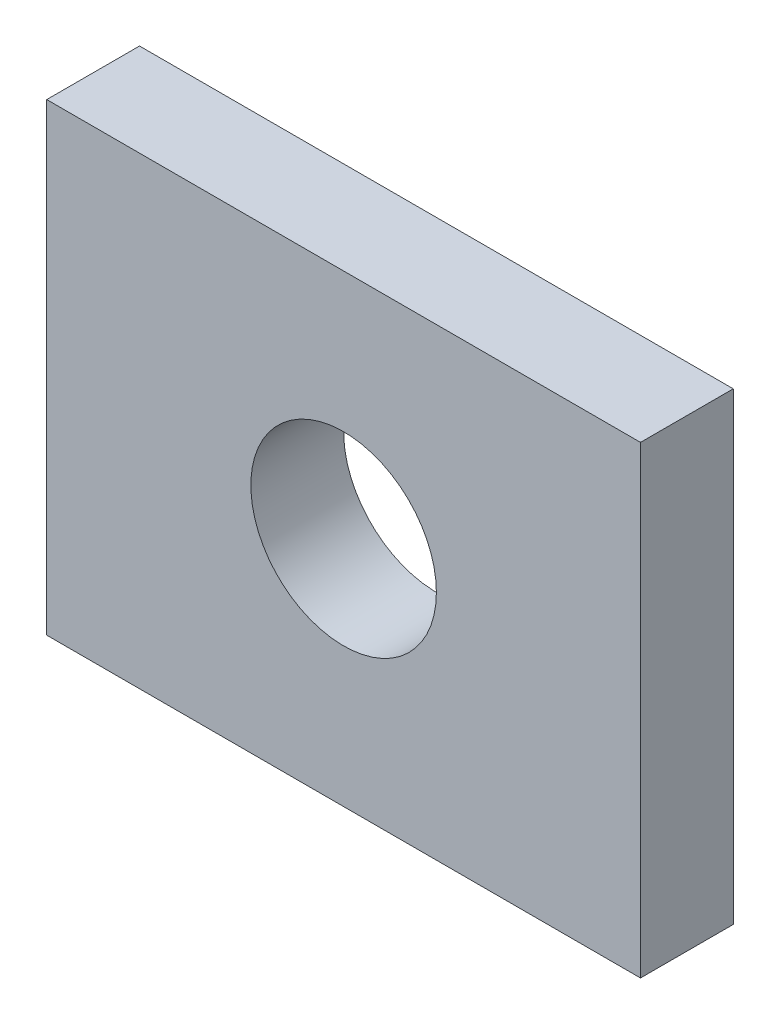
ISO-10303-21;
HEADER;
FILE_DESCRIPTION(('STEP AP214'),'2;1');
FILE_NAME('part.step','',(''),(''),'','','');
FILE_SCHEMA(('AUTOMOTIVE_DESIGN { 1 0 10303 214 1 1 1 1 }'));
ENDSEC;
DATA;
#1=APPLICATION_CONTEXT('core data for automotive mechanical design processes');
#2=APPLICATION_PROTOCOL_DEFINITION('international standard','automotive_design',2000,#1);
#3=PRODUCT_CONTEXT('',#1,'mechanical');
#4=PRODUCT('Part','Part','',(#3));
#5=PRODUCT_RELATED_PRODUCT_CATEGORY('part','',(#4));
#6=PRODUCT_DEFINITION_FORMATION('','',#4);
#7=PRODUCT_DEFINITION_CONTEXT('part definition',#1,'design');
#8=PRODUCT_DEFINITION('design','',#6,#7);
#9=PRODUCT_DEFINITION_SHAPE('','',#8);
#10=(LENGTH_UNIT() NAMED_UNIT(*) SI_UNIT(.MILLI.,.METRE.));
#11=(NAMED_UNIT(*) PLANE_ANGLE_UNIT() SI_UNIT($,.RADIAN.));
#12=(NAMED_UNIT(*) SI_UNIT($,.STERADIAN.) SOLID_ANGLE_UNIT());
#13=UNCERTAINTY_MEASURE_WITH_UNIT(LENGTH_MEASURE(1.E-05),#10,'distance_accuracy_value','');
#14=(GEOMETRIC_REPRESENTATION_CONTEXT(3) GLOBAL_UNCERTAINTY_ASSIGNED_CONTEXT((#13)) GLOBAL_UNIT_ASSIGNED_CONTEXT((#10,
#11,#12)) REPRESENTATION_CONTEXT('',''));
#15=CARTESIAN_POINT('',(0.,0.,0.));
#16=DIRECTION('',(0.,0.,1.));
#17=DIRECTION('',(1.,0.,0.));
#18=AXIS2_PLACEMENT_3D('',#15,#16,#17);
#19=CARTESIAN_POINT('',(0.,0.,5.));
#20=DIRECTION('',(0.,0.,-1.));
#21=DIRECTION('',(-1.,0.,0.));
#22=AXIS2_PLACEMENT_3D('',#19,#20,#21);
#23=PLANE('',#22);
#24=DIRECTION('',(0.,1.,0.));
#25=VECTOR('',#24,1.);
#26=CARTESIAN_POINT('',(16.,-12.5,5.));
#27=LINE('',#26,#25);
#28=CARTESIAN_POINT('',(16.,-12.5,5.));
#29=VERTEX_POINT('',#28);
#30=CARTESIAN_POINT('',(16.,12.5,5.));
#31=VERTEX_POINT('',#30);
#32=EDGE_CURVE('E96',#29,#31,#27,.T.);
#33=ORIENTED_EDGE('',*,*,#32,.T.);
#34=DIRECTION('',(-1.,0.,0.));
#35=VECTOR('',#34,1.);
#36=CARTESIAN_POINT('',(-16.,12.5,5.));
#37=LINE('',#36,#35);
#38=CARTESIAN_POINT('',(-16.,12.5,5.));
#39=VERTEX_POINT('',#38);
#40=EDGE_CURVE('E91',#31,#39,#37,.T.);
#41=ORIENTED_EDGE('',*,*,#40,.T.);
#42=DIRECTION('',(0.,-1.,0.));
#43=VECTOR('',#42,1.);
#44=CARTESIAN_POINT('',(-16.,-12.5,5.));
#45=LINE('',#44,#43);
#46=CARTESIAN_POINT('',(-16.,-12.5,5.));
#47=VERTEX_POINT('',#46);
#48=EDGE_CURVE('E94',#39,#47,#45,.T.);
#49=ORIENTED_EDGE('',*,*,#48,.T.);
#50=DIRECTION('',(1.,0.,0.));
#51=VECTOR('',#50,1.);
#52=CARTESIAN_POINT('',(-16.,-12.5,5.));
#53=LINE('',#52,#51);
#54=EDGE_CURVE('E61',#47,#29,#53,.T.);
#55=ORIENTED_EDGE('',*,*,#54,.T.);
#56=EDGE_LOOP('',(#33,#41,#49,#55));
#57=FACE_BOUND('',#56,.T.);
#58=CARTESIAN_POINT('',(0.,0.,5.));
#59=DIRECTION('',(0.,0.,1.));
#60=DIRECTION('',(1.,0.,0.));
#61=AXIS2_PLACEMENT_3D('',#58,#59,#60);
#62=CIRCLE('',#61,5.);
#63=CARTESIAN_POINT('',(5.,0.,5.));
#64=VERTEX_POINT('',#63);
#65=EDGE_CURVE('E116',#64,#64,#62,.T.);
#66=ORIENTED_EDGE('',*,*,#65,.F.);
#67=EDGE_LOOP('',(#66));
#68=FACE_BOUND('',#67,.T.);
#69=ADVANCED_FACE('F43',(#57,#68),#23,.F.);
#70=CARTESIAN_POINT('',(0.,0.,0.));
#71=DIRECTION('',(0.,0.,-1.));
#72=DIRECTION('',(-1.,0.,0.));
#73=AXIS2_PLACEMENT_3D('',#70,#71,#72);
#74=PLANE('',#73);
#75=DIRECTION('',(0.,1.,0.));
#76=VECTOR('',#75,1.);
#77=CARTESIAN_POINT('',(16.,-12.5,0.));
#78=LINE('',#77,#76);
#79=CARTESIAN_POINT('',(16.,-12.5,0.));
#80=VERTEX_POINT('',#79);
#81=CARTESIAN_POINT('',(16.,12.5,0.));
#82=VERTEX_POINT('',#81);
#83=EDGE_CURVE('E112',#80,#82,#78,.T.);
#84=ORIENTED_EDGE('',*,*,#83,.F.);
#85=DIRECTION('',(1.,0.,0.));
#86=VECTOR('',#85,1.);
#87=CARTESIAN_POINT('',(-16.,-12.5,0.));
#88=LINE('',#87,#86);
#89=CARTESIAN_POINT('',(-16.,-12.5,0.));
#90=VERTEX_POINT('',#89);
#91=EDGE_CURVE('E84',#90,#80,#88,.T.);
#92=ORIENTED_EDGE('',*,*,#91,.F.);
#93=DIRECTION('',(0.,-1.,0.));
#94=VECTOR('',#93,1.);
#95=CARTESIAN_POINT('',(-16.,-12.5,0.));
#96=LINE('',#95,#94);
#97=CARTESIAN_POINT('',(-16.,12.5,0.));
#98=VERTEX_POINT('',#97);
#99=EDGE_CURVE('E78',#98,#90,#96,.T.);
#100=ORIENTED_EDGE('',*,*,#99,.F.);
#101=DIRECTION('',(-1.,0.,0.));
#102=VECTOR('',#101,1.);
#103=CARTESIAN_POINT('',(-16.,12.5,0.));
#104=LINE('',#103,#102);
#105=EDGE_CURVE('E101',#82,#98,#104,.T.);
#106=ORIENTED_EDGE('',*,*,#105,.F.);
#107=EDGE_LOOP('',(#84,#92,#100,#106));
#108=FACE_BOUND('',#107,.T.);
#109=CARTESIAN_POINT('',(0.,0.,0.));
#110=DIRECTION('',(0.,0.,1.));
#111=DIRECTION('',(1.,0.,0.));
#112=AXIS2_PLACEMENT_3D('',#109,#110,#111);
#113=CIRCLE('',#112,5.);
#114=CARTESIAN_POINT('',(5.,0.,0.));
#115=VERTEX_POINT('',#114);
#116=EDGE_CURVE('E134',#115,#115,#113,.T.);
#117=ORIENTED_EDGE('',*,*,#116,.T.);
#118=EDGE_LOOP('',(#117));
#119=FACE_BOUND('',#118,.T.);
#120=ADVANCED_FACE('F129',(#108,#119),#74,.T.);
#121=CARTESIAN_POINT('',(16.,-12.5,5.));
#122=DIRECTION('',(-1.,0.,0.));
#123=DIRECTION('',(0.,0.,1.));
#124=AXIS2_PLACEMENT_3D('',#121,#122,#123);
#125=PLANE('',#124);
#126=ORIENTED_EDGE('',*,*,#83,.T.);
#127=DIRECTION('',(0.,0.,-1.));
#128=VECTOR('',#127,1.);
#129=CARTESIAN_POINT('',(16.,12.5,5.));
#130=LINE('',#129,#128);
#131=EDGE_CURVE('E11',#31,#82,#130,.T.);
#132=ORIENTED_EDGE('',*,*,#131,.F.);
#133=ORIENTED_EDGE('',*,*,#32,.F.);
#134=DIRECTION('',(0.,0.,-1.));
#135=VECTOR('',#134,1.);
#136=CARTESIAN_POINT('',(16.,-12.5,5.));
#137=LINE('',#136,#135);
#138=EDGE_CURVE('E108',#29,#80,#137,.T.);
#139=ORIENTED_EDGE('',*,*,#138,.T.);
#140=EDGE_LOOP('',(#126,#132,#133,#139));
#141=FACE_BOUND('',#140,.T.);
#142=ADVANCED_FACE('F45',(#141),#125,.F.);
#143=CARTESIAN_POINT('',(-16.,12.5,5.));
#144=DIRECTION('',(0.,-1.,0.));
#145=DIRECTION('',(0.,0.,-1.));
#146=AXIS2_PLACEMENT_3D('',#143,#144,#145);
#147=PLANE('',#146);
#148=ORIENTED_EDGE('',*,*,#105,.T.);
#149=DIRECTION('',(0.,0.,-1.));
#150=VECTOR('',#149,1.);
#151=CARTESIAN_POINT('',(-16.,12.5,5.));
#152=LINE('',#151,#150);
#153=EDGE_CURVE('E53',#39,#98,#152,.T.);
#154=ORIENTED_EDGE('',*,*,#153,.F.);
#155=ORIENTED_EDGE('',*,*,#40,.F.);
#156=ORIENTED_EDGE('',*,*,#131,.T.);
#157=EDGE_LOOP('',(#148,#154,#155,#156));
#158=FACE_BOUND('',#157,.T.);
#159=ADVANCED_FACE('F100',(#158),#147,.F.);
#160=CARTESIAN_POINT('',(-16.,-12.5,5.));
#161=DIRECTION('',(1.,0.,0.));
#162=DIRECTION('',(0.,0.,-1.));
#163=AXIS2_PLACEMENT_3D('',#160,#161,#162);
#164=PLANE('',#163);
#165=ORIENTED_EDGE('',*,*,#99,.T.);
#166=DIRECTION('',(0.,0.,-1.));
#167=VECTOR('',#166,1.);
#168=CARTESIAN_POINT('',(-16.,-12.5,5.));
#169=LINE('',#168,#167);
#170=EDGE_CURVE('E103',#47,#90,#169,.T.);
#171=ORIENTED_EDGE('',*,*,#170,.F.);
#172=ORIENTED_EDGE('',*,*,#48,.F.);
#173=ORIENTED_EDGE('',*,*,#153,.T.);
#174=EDGE_LOOP('',(#165,#171,#172,#173));
#175=FACE_BOUND('',#174,.T.);
#176=ADVANCED_FACE('F104',(#175),#164,.F.);
#177=CARTESIAN_POINT('',(-16.,-12.5,5.));
#178=DIRECTION('',(0.,1.,0.));
#179=DIRECTION('',(0.,0.,1.));
#180=AXIS2_PLACEMENT_3D('',#177,#178,#179);
#181=PLANE('',#180);
#182=ORIENTED_EDGE('',*,*,#91,.T.);
#183=ORIENTED_EDGE('',*,*,#138,.F.);
#184=ORIENTED_EDGE('',*,*,#54,.F.);
#185=ORIENTED_EDGE('',*,*,#170,.T.);
#186=EDGE_LOOP('',(#182,#183,#184,#185));
#187=FACE_BOUND('',#186,.T.);
#188=ADVANCED_FACE('F126',(#187),#181,.F.);
#189=CARTESIAN_POINT('',(0.,0.,5.));
#190=DIRECTION('',(0.,0.,-1.));
#191=DIRECTION('',(-1.,0.,0.));
#192=AXIS2_PLACEMENT_3D('',#189,#190,#191);
#193=CYLINDRICAL_SURFACE('',#192,5.);
#194=ORIENTED_EDGE('',*,*,#65,.T.);
#195=EDGE_LOOP('',(#194));
#196=FACE_BOUND('',#195,.T.);
#197=ORIENTED_EDGE('',*,*,#116,.F.);
#198=EDGE_LOOP('',(#197));
#199=FACE_BOUND('',#198,.T.);
#200=ADVANCED_FACE('F142',(#196,#199),#193,.F.);
#201=CLOSED_SHELL('',(#69,#120,#142,#159,#176,#188,#200));
#202=MANIFOLD_SOLID_BREP('B2',#201);
#203=ADVANCED_BREP_SHAPE_REPRESENTATION('',(#18,#202),#14);
#204=SHAPE_DEFINITION_REPRESENTATION(#9,#203);
ENDSEC;
END-ISO-10303-21;
